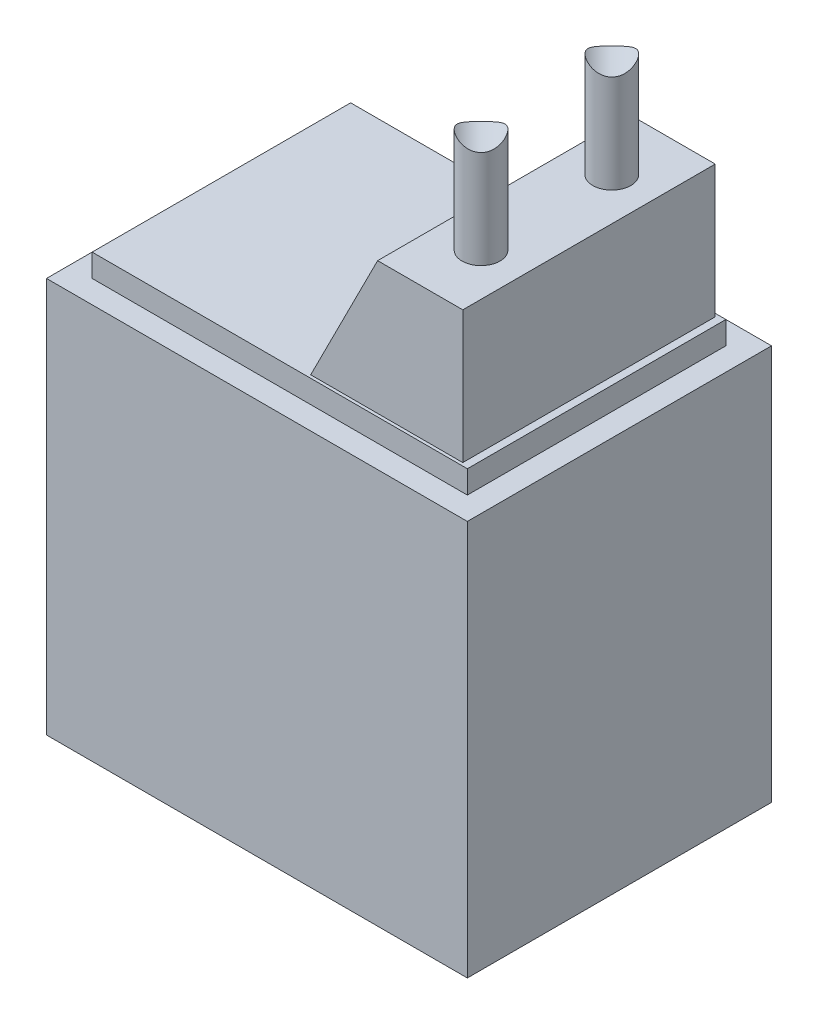
ISO-10303-21;
HEADER;
FILE_DESCRIPTION(('STEP AP214'),'2;1');
FILE_NAME('part.step','',(''),(''),'','','');
FILE_SCHEMA(('AUTOMOTIVE_DESIGN { 1 0 10303 214 1 1 1 1 }'));
ENDSEC;
DATA;
#1=APPLICATION_CONTEXT('core data for automotive mechanical design processes');
#2=APPLICATION_PROTOCOL_DEFINITION('international standard','automotive_design',2000,#1);
#3=PRODUCT_CONTEXT('',#1,'mechanical');
#4=PRODUCT('Part','Part','',(#3));
#5=PRODUCT_RELATED_PRODUCT_CATEGORY('part','',(#4));
#6=PRODUCT_DEFINITION_FORMATION('','',#4);
#7=PRODUCT_DEFINITION_CONTEXT('part definition',#1,'design');
#8=PRODUCT_DEFINITION('design','',#6,#7);
#9=PRODUCT_DEFINITION_SHAPE('','',#8);
#10=(LENGTH_UNIT() NAMED_UNIT(*) SI_UNIT(.MILLI.,.METRE.));
#11=(NAMED_UNIT(*) PLANE_ANGLE_UNIT() SI_UNIT($,.RADIAN.));
#12=(NAMED_UNIT(*) SI_UNIT($,.STERADIAN.) SOLID_ANGLE_UNIT());
#13=UNCERTAINTY_MEASURE_WITH_UNIT(LENGTH_MEASURE(1.E-05),#10,'distance_accuracy_value','');
#14=(GEOMETRIC_REPRESENTATION_CONTEXT(3) GLOBAL_UNCERTAINTY_ASSIGNED_CONTEXT((#13)) GLOBAL_UNIT_ASSIGNED_CONTEXT((#10,
#11,#12)) REPRESENTATION_CONTEXT('',''));
#15=CARTESIAN_POINT('',(0.,0.,0.));
#16=DIRECTION('',(0.,0.,1.));
#17=DIRECTION('',(1.,0.,0.));
#18=AXIS2_PLACEMENT_3D('',#15,#16,#17);
#19=CARTESIAN_POINT('',(20.4815,6.5,5.));
#20=DIRECTION('',(0.,0.,1.));
#21=DIRECTION('',(1.,0.,0.));
#22=AXIS2_PLACEMENT_3D('',#19,#20,#21);
#23=PLANE('',#22);
#24=DIRECTION('',(-1.,0.,0.));
#25=VECTOR('',#24,1.);
#26=CARTESIAN_POINT('',(20.4815,0.,5.));
#27=LINE('',#26,#25);
#28=CARTESIAN_POINT('',(27.4,0.,5.));
#29=VERTEX_POINT('',#28);
#30=CARTESIAN_POINT('',(13.563,0.,5.));
#31=VERTEX_POINT('',#30);
#32=EDGE_CURVE('E225',#29,#31,#27,.T.);
#33=ORIENTED_EDGE('',*,*,#32,.F.);
#34=DIRECTION('',(0.,-1.,0.));
#35=VECTOR('',#34,1.);
#36=CARTESIAN_POINT('',(27.4,6.5,5.));
#37=LINE('',#36,#35);
#38=CARTESIAN_POINT('',(27.4,13.,5.));
#39=VERTEX_POINT('',#38);
#40=EDGE_CURVE('E215',#39,#29,#37,.T.);
#41=ORIENTED_EDGE('',*,*,#40,.F.);
#42=DIRECTION('',(1.,0.,0.));
#43=VECTOR('',#42,1.);
#44=CARTESIAN_POINT('',(20.4815,13.,5.));
#45=LINE('',#44,#43);
#46=CARTESIAN_POINT('',(13.563,13.,5.));
#47=VERTEX_POINT('',#46);
#48=EDGE_CURVE('E219',#47,#39,#45,.T.);
#49=ORIENTED_EDGE('',*,*,#48,.F.);
#50=DIRECTION('',(0.,1.,0.));
#51=VECTOR('',#50,1.);
#52=CARTESIAN_POINT('',(13.563,6.5,5.));
#53=LINE('',#52,#51);
#54=EDGE_CURVE('E222',#31,#47,#53,.T.);
#55=ORIENTED_EDGE('',*,*,#54,.F.);
#56=EDGE_LOOP('',(#33,#41,#49,#55));
#57=FACE_BOUND('',#56,.T.);
#58=ADVANCED_FACE('F16',(#57),#23,.T.);
#59=CARTESIAN_POINT('',(20.4815,0.,-5.));
#60=DIRECTION('',(0.,-1.,0.));
#61=DIRECTION('',(0.,0.,-1.));
#62=AXIS2_PLACEMENT_3D('',#59,#60,#61);
#63=PLANE('',#62);
#64=DIRECTION('',(0.,0.,1.));
#65=VECTOR('',#64,1.);
#66=CARTESIAN_POINT('',(27.4,0.,-5.));
#67=LINE('',#66,#65);
#68=CARTESIAN_POINT('',(27.4,0.,-5.));
#69=VERTEX_POINT('',#68);
#70=EDGE_CURVE('E192',#69,#29,#67,.T.);
#71=ORIENTED_EDGE('',*,*,#70,.T.);
#72=ORIENTED_EDGE('',*,*,#32,.T.);
#73=DIRECTION('',(0.,0.,1.));
#74=VECTOR('',#73,1.);
#75=CARTESIAN_POINT('',(13.563,0.,-5.));
#76=LINE('',#75,#74);
#77=CARTESIAN_POINT('',(13.563,0.,-5.));
#78=VERTEX_POINT('',#77);
#79=EDGE_CURVE('E211',#78,#31,#76,.T.);
#80=ORIENTED_EDGE('',*,*,#79,.F.);
#81=DIRECTION('',(1.,0.,0.));
#82=VECTOR('',#81,1.);
#83=CARTESIAN_POINT('',(20.4815,0.,-5.));
#84=LINE('',#83,#82);
#85=EDGE_CURVE('E183',#78,#69,#84,.T.);
#86=ORIENTED_EDGE('',*,*,#85,.T.);
#87=EDGE_LOOP('',(#71,#72,#80,#86));
#88=FACE_BOUND('',#87,.T.);
#89=ADVANCED_FACE('F293',(#88),#63,.T.);
#90=CARTESIAN_POINT('',(13.563,6.5,-5.));
#91=DIRECTION('',(-1.,0.,0.));
#92=DIRECTION('',(0.,0.,1.));
#93=AXIS2_PLACEMENT_3D('',#90,#91,#92);
#94=PLANE('',#93);
#95=CARTESIAN_POINT('',(13.563,6.5,0.));
#96=DIRECTION('',(-1.,0.,0.));
#97=DIRECTION('',(0.,0.,1.));
#98=AXIS2_PLACEMENT_3D('',#95,#96,#97);
#99=CIRCLE('',#98,1.);
#100=CARTESIAN_POINT('',(13.563,6.5,1.));
#101=VERTEX_POINT('',#100);
#102=EDGE_CURVE('E19',#101,#101,#99,.T.);
#103=ORIENTED_EDGE('',*,*,#102,.F.);
#104=EDGE_LOOP('',(#103));
#105=FACE_BOUND('',#104,.T.);
#106=ORIENTED_EDGE('',*,*,#79,.T.);
#107=ORIENTED_EDGE('',*,*,#54,.T.);
#108=DIRECTION('',(0.,0.,1.));
#109=VECTOR('',#108,1.);
#110=CARTESIAN_POINT('',(13.563,13.,-5.));
#111=LINE('',#110,#109);
#112=CARTESIAN_POINT('',(13.563,13.,-5.));
#113=VERTEX_POINT('',#112);
#114=EDGE_CURVE('E207',#113,#47,#111,.T.);
#115=ORIENTED_EDGE('',*,*,#114,.F.);
#116=DIRECTION('',(0.,-1.,0.));
#117=VECTOR('',#116,1.);
#118=CARTESIAN_POINT('',(13.563,6.5,-5.));
#119=LINE('',#118,#117);
#120=EDGE_CURVE('E187',#113,#78,#119,.T.);
#121=ORIENTED_EDGE('',*,*,#120,.T.);
#122=EDGE_LOOP('',(#106,#107,#115,#121));
#123=FACE_BOUND('',#122,.T.);
#124=ADVANCED_FACE('F298',(#105,#123),#94,.T.);
#125=CARTESIAN_POINT('',(20.4815,13.,-5.));
#126=DIRECTION('',(0.,1.,0.));
#127=DIRECTION('',(0.,0.,1.));
#128=AXIS2_PLACEMENT_3D('',#125,#126,#127);
#129=PLANE('',#128);
#130=DIRECTION('',(1.,0.,0.));
#131=VECTOR('',#130,1.);
#132=CARTESIAN_POINT('',(20.4815,13.,4.25));
#133=LINE('',#132,#131);
#134=CARTESIAN_POINT('',(14.313,13.,4.25));
#135=VERTEX_POINT('',#134);
#136=CARTESIAN_POINT('',(26.65,13.,4.25));
#137=VERTEX_POINT('',#136);
#138=EDGE_CURVE('E41',#135,#137,#133,.T.);
#139=ORIENTED_EDGE('',*,*,#138,.F.);
#140=DIRECTION('',(0.,0.,1.));
#141=VECTOR('',#140,1.);
#142=CARTESIAN_POINT('',(14.313,13.,-5.));
#143=LINE('',#142,#141);
#144=CARTESIAN_POINT('',(14.313,13.,-4.25));
#145=VERTEX_POINT('',#144);
#146=EDGE_CURVE('E236',#145,#135,#143,.T.);
#147=ORIENTED_EDGE('',*,*,#146,.F.);
#148=DIRECTION('',(-1.,0.,0.));
#149=VECTOR('',#148,1.);
#150=CARTESIAN_POINT('',(20.4815,13.,-4.25));
#151=LINE('',#150,#149);
#152=CARTESIAN_POINT('',(26.65,13.,-4.25));
#153=VERTEX_POINT('',#152);
#154=EDGE_CURVE('E232',#153,#145,#151,.T.);
#155=ORIENTED_EDGE('',*,*,#154,.F.);
#156=DIRECTION('',(0.,0.,-1.));
#157=VECTOR('',#156,1.);
#158=CARTESIAN_POINT('',(26.65,13.,-5.));
#159=LINE('',#158,#157);
#160=EDGE_CURVE('E228',#137,#153,#159,.T.);
#161=ORIENTED_EDGE('',*,*,#160,.F.);
#162=EDGE_LOOP('',(#139,#147,#155,#161));
#163=FACE_BOUND('',#162,.T.);
#164=ORIENTED_EDGE('',*,*,#114,.T.);
#165=ORIENTED_EDGE('',*,*,#48,.T.);
#166=DIRECTION('',(0.,0.,1.));
#167=VECTOR('',#166,1.);
#168=CARTESIAN_POINT('',(27.4,13.,-5.));
#169=LINE('',#168,#167);
#170=CARTESIAN_POINT('',(27.4,13.,-5.));
#171=VERTEX_POINT('',#170);
#172=EDGE_CURVE('E203',#171,#39,#169,.T.);
#173=ORIENTED_EDGE('',*,*,#172,.F.);
#174=DIRECTION('',(-1.,0.,0.));
#175=VECTOR('',#174,1.);
#176=CARTESIAN_POINT('',(20.4815,13.,-5.));
#177=LINE('',#176,#175);
#178=EDGE_CURVE('E193',#171,#113,#177,.T.);
#179=ORIENTED_EDGE('',*,*,#178,.T.);
#180=EDGE_LOOP('',(#164,#165,#173,#179));
#181=FACE_BOUND('',#180,.T.);
#182=ADVANCED_FACE('F312',(#163,#181),#129,.T.);
#183=CARTESIAN_POINT('',(20.4815,6.5,-5.));
#184=DIRECTION('',(0.,0.,-1.));
#185=DIRECTION('',(-1.,0.,0.));
#186=AXIS2_PLACEMENT_3D('',#183,#184,#185);
#187=PLANE('',#186);
#188=DIRECTION('',(0.,1.,0.));
#189=VECTOR('',#188,1.);
#190=CARTESIAN_POINT('',(27.4,6.5,-5.));
#191=LINE('',#190,#189);
#192=EDGE_CURVE('E188',#69,#171,#191,.T.);
#193=ORIENTED_EDGE('',*,*,#192,.F.);
#194=ORIENTED_EDGE('',*,*,#85,.F.);
#195=ORIENTED_EDGE('',*,*,#120,.F.);
#196=ORIENTED_EDGE('',*,*,#178,.F.);
#197=EDGE_LOOP('',(#193,#194,#195,#196));
#198=FACE_BOUND('',#197,.T.);
#199=ADVANCED_FACE('F310',(#198),#187,.T.);
#200=CARTESIAN_POINT('',(27.4,6.5,-5.));
#201=DIRECTION('',(1.,0.,0.));
#202=DIRECTION('',(0.,0.,-1.));
#203=AXIS2_PLACEMENT_3D('',#200,#201,#202);
#204=PLANE('',#203);
#205=ORIENTED_EDGE('',*,*,#192,.T.);
#206=ORIENTED_EDGE('',*,*,#172,.T.);
#207=ORIENTED_EDGE('',*,*,#40,.T.);
#208=ORIENTED_EDGE('',*,*,#70,.F.);
#209=EDGE_LOOP('',(#205,#206,#207,#208));
#210=FACE_BOUND('',#209,.T.);
#211=ADVANCED_FACE('F304',(#210),#204,.T.);
#212=CARTESIAN_POINT('',(20.4815,12.875,4.25));
#213=DIRECTION('',(0.,0.,1.));
#214=DIRECTION('',(1.,0.,0.));
#215=AXIS2_PLACEMENT_3D('',#212,#213,#214);
#216=PLANE('',#215);
#217=DIRECTION('',(0.,1.,0.));
#218=VECTOR('',#217,1.);
#219=CARTESIAN_POINT('',(14.313,12.875,4.25));
#220=LINE('',#219,#218);
#221=CARTESIAN_POINT('',(14.313,13.75,4.25));
#222=VERTEX_POINT('',#221);
#223=EDGE_CURVE('E180',#135,#222,#220,.T.);
#224=ORIENTED_EDGE('',*,*,#223,.F.);
#225=ORIENTED_EDGE('',*,*,#138,.T.);
#226=DIRECTION('',(0.,-1.,0.));
#227=VECTOR('',#226,1.);
#228=CARTESIAN_POINT('',(26.65,12.875,4.25));
#229=LINE('',#228,#227);
#230=CARTESIAN_POINT('',(26.65,13.75,4.25));
#231=VERTEX_POINT('',#230);
#232=EDGE_CURVE('E173',#231,#137,#229,.T.);
#233=ORIENTED_EDGE('',*,*,#232,.F.);
#234=DIRECTION('',(1.,0.,0.));
#235=VECTOR('',#234,1.);
#236=CARTESIAN_POINT('',(20.4815,13.75,4.25));
#237=LINE('',#236,#235);
#238=EDGE_CURVE('E177',#222,#231,#237,.T.);
#239=ORIENTED_EDGE('',*,*,#238,.F.);
#240=EDGE_LOOP('',(#224,#225,#233,#239));
#241=FACE_BOUND('',#240,.T.);
#242=ADVANCED_FACE('F325',(#241),#216,.T.);
#243=CARTESIAN_POINT('',(14.313,12.875,-4.25));
#244=DIRECTION('',(-1.,0.,0.));
#245=DIRECTION('',(0.,0.,1.));
#246=AXIS2_PLACEMENT_3D('',#243,#244,#245);
#247=PLANE('',#246);
#248=DIRECTION('',(0.,-1.,0.));
#249=VECTOR('',#248,1.);
#250=CARTESIAN_POINT('',(14.313,12.875,-4.25));
#251=LINE('',#250,#249);
#252=CARTESIAN_POINT('',(14.313,13.75,-4.25));
#253=VERTEX_POINT('',#252);
#254=EDGE_CURVE('E151',#253,#145,#251,.T.);
#255=ORIENTED_EDGE('',*,*,#254,.T.);
#256=ORIENTED_EDGE('',*,*,#146,.T.);
#257=ORIENTED_EDGE('',*,*,#223,.T.);
#258=DIRECTION('',(0.,0.,1.));
#259=VECTOR('',#258,1.);
#260=CARTESIAN_POINT('',(14.313,13.75,-4.25));
#261=LINE('',#260,#259);
#262=EDGE_CURVE('E169',#253,#222,#261,.T.);
#263=ORIENTED_EDGE('',*,*,#262,.F.);
#264=EDGE_LOOP('',(#255,#256,#257,#263));
#265=FACE_BOUND('',#264,.T.);
#266=ADVANCED_FACE('F330',(#265),#247,.T.);
#267=CARTESIAN_POINT('',(20.4815,13.75,-4.25));
#268=DIRECTION('',(0.,1.,0.));
#269=DIRECTION('',(0.,0.,1.));
#270=AXIS2_PLACEMENT_3D('',#267,#268,#269);
#271=PLANE('',#270);
#272=DIRECTION('',(1.,0.,0.));
#273=VECTOR('',#272,1.);
#274=CARTESIAN_POINT('',(20.4815,13.75,4.15));
#275=LINE('',#274,#273);
#276=CARTESIAN_POINT('',(21.4,13.75,4.15));
#277=VERTEX_POINT('',#276);
#278=CARTESIAN_POINT('',(26.4,13.75,4.15));
#279=VERTEX_POINT('',#278);
#280=EDGE_CURVE('E11',#277,#279,#275,.T.);
#281=ORIENTED_EDGE('',*,*,#280,.F.);
#282=DIRECTION('',(0.,0.,-1.));
#283=VECTOR('',#282,1.);
#284=CARTESIAN_POINT('',(21.4,13.75,4.15));
#285=LINE('',#284,#283);
#286=CARTESIAN_POINT('',(21.4,13.75,-4.15));
#287=VERTEX_POINT('',#286);
#288=EDGE_CURVE('E123',#277,#287,#285,.T.);
#289=ORIENTED_EDGE('',*,*,#288,.T.);
#290=DIRECTION('',(1.,0.,0.));
#291=VECTOR('',#290,1.);
#292=CARTESIAN_POINT('',(20.4815,13.75,-4.15));
#293=LINE('',#292,#291);
#294=CARTESIAN_POINT('',(26.4,13.75,-4.15));
#295=VERTEX_POINT('',#294);
#296=EDGE_CURVE('E241',#287,#295,#293,.T.);
#297=ORIENTED_EDGE('',*,*,#296,.T.);
#298=DIRECTION('',(0.,0.,1.));
#299=VECTOR('',#298,1.);
#300=CARTESIAN_POINT('',(26.4,13.75,-4.25));
#301=LINE('',#300,#299);
#302=EDGE_CURVE('E25',#295,#279,#301,.T.);
#303=ORIENTED_EDGE('',*,*,#302,.T.);
#304=EDGE_LOOP('',(#281,#289,#297,#303));
#305=FACE_BOUND('',#304,.T.);
#306=ORIENTED_EDGE('',*,*,#262,.T.);
#307=ORIENTED_EDGE('',*,*,#238,.T.);
#308=DIRECTION('',(0.,0.,1.));
#309=VECTOR('',#308,1.);
#310=CARTESIAN_POINT('',(26.65,13.75,-4.25));
#311=LINE('',#310,#309);
#312=CARTESIAN_POINT('',(26.65,13.75,-4.25));
#313=VERTEX_POINT('',#312);
#314=EDGE_CURVE('E158',#313,#231,#311,.T.);
#315=ORIENTED_EDGE('',*,*,#314,.F.);
#316=DIRECTION('',(-1.,0.,0.));
#317=VECTOR('',#316,1.);
#318=CARTESIAN_POINT('',(20.4815,13.75,-4.25));
#319=LINE('',#318,#317);
#320=EDGE_CURVE('E159',#313,#253,#319,.T.);
#321=ORIENTED_EDGE('',*,*,#320,.T.);
#322=EDGE_LOOP('',(#306,#307,#315,#321));
#323=FACE_BOUND('',#322,.T.);
#324=ADVANCED_FACE('F334',(#305,#323),#271,.T.);
#325=CARTESIAN_POINT('',(20.4815,12.875,-4.25));
#326=DIRECTION('',(0.,0.,-1.));
#327=DIRECTION('',(-1.,0.,0.));
#328=AXIS2_PLACEMENT_3D('',#325,#326,#327);
#329=PLANE('',#328);
#330=DIRECTION('',(0.,1.,0.));
#331=VECTOR('',#330,1.);
#332=CARTESIAN_POINT('',(26.65,12.875,-4.25));
#333=LINE('',#332,#331);
#334=EDGE_CURVE('E155',#153,#313,#333,.T.);
#335=ORIENTED_EDGE('',*,*,#334,.F.);
#336=ORIENTED_EDGE('',*,*,#154,.T.);
#337=ORIENTED_EDGE('',*,*,#254,.F.);
#338=ORIENTED_EDGE('',*,*,#320,.F.);
#339=EDGE_LOOP('',(#335,#336,#337,#338));
#340=FACE_BOUND('',#339,.T.);
#341=ADVANCED_FACE('F338',(#340),#329,.T.);
#342=CARTESIAN_POINT('',(26.65,12.875,-4.25));
#343=DIRECTION('',(1.,0.,0.));
#344=DIRECTION('',(0.,0.,-1.));
#345=AXIS2_PLACEMENT_3D('',#342,#343,#344);
#346=PLANE('',#345);
#347=ORIENTED_EDGE('',*,*,#232,.T.);
#348=ORIENTED_EDGE('',*,*,#160,.T.);
#349=ORIENTED_EDGE('',*,*,#334,.T.);
#350=ORIENTED_EDGE('',*,*,#314,.T.);
#351=EDGE_LOOP('',(#347,#348,#349,#350));
#352=FACE_BOUND('',#351,.T.);
#353=ADVANCED_FACE('F340',(#352),#346,.T.);
#354=CARTESIAN_POINT('',(26.4,18.1,4.15));
#355=DIRECTION('',(0.,-1.,0.));
#356=DIRECTION('',(0.,0.,-1.));
#357=AXIS2_PLACEMENT_3D('',#354,#355,#356);
#358=PLANE('',#357);
#359=CARTESIAN_POINT('',(25.,18.1,2.15));
#360=DIRECTION('',(0.,-1.,0.));
#361=DIRECTION('',(0.,0.,-1.));
#362=AXIS2_PLACEMENT_3D('',#359,#360,#361);
#363=CIRCLE('',#362,0.625);
#364=CARTESIAN_POINT('',(25.,18.1,1.525));
#365=VERTEX_POINT('',#364);
#366=EDGE_CURVE('E245',#365,#365,#363,.T.);
#367=ORIENTED_EDGE('',*,*,#366,.T.);
#368=EDGE_LOOP('',(#367));
#369=FACE_BOUND('',#368,.T.);
#370=CARTESIAN_POINT('',(25.,18.1,-2.15));
#371=DIRECTION('',(0.,-1.,0.));
#372=DIRECTION('',(0.,0.,-1.));
#373=AXIS2_PLACEMENT_3D('',#370,#371,#372);
#374=CIRCLE('',#373,0.625);
#375=CARTESIAN_POINT('',(25.,18.1,-2.775));
#376=VERTEX_POINT('',#375);
#377=EDGE_CURVE('E129',#376,#376,#374,.T.);
#378=ORIENTED_EDGE('',*,*,#377,.T.);
#379=EDGE_LOOP('',(#378));
#380=FACE_BOUND('',#379,.T.);
#381=DIRECTION('',(-1.,0.,0.));
#382=VECTOR('',#381,1.);
#383=CARTESIAN_POINT('',(26.4,18.1,-4.15));
#384=LINE('',#383,#382);
#385=CARTESIAN_POINT('',(26.4,18.1,-4.15));
#386=VERTEX_POINT('',#385);
#387=CARTESIAN_POINT('',(23.6,18.1,-4.15));
#388=VERTEX_POINT('',#387);
#389=EDGE_CURVE('E120',#386,#388,#384,.T.);
#390=ORIENTED_EDGE('',*,*,#389,.T.);
#391=DIRECTION('',(0.,0.,-1.));
#392=VECTOR('',#391,1.);
#393=CARTESIAN_POINT('',(23.6,18.1,4.15));
#394=LINE('',#393,#392);
#395=CARTESIAN_POINT('',(23.6,18.1,4.15));
#396=VERTEX_POINT('',#395);
#397=EDGE_CURVE('E149',#396,#388,#394,.T.);
#398=ORIENTED_EDGE('',*,*,#397,.F.);
#399=DIRECTION('',(-1.,0.,0.));
#400=VECTOR('',#399,1.);
#401=CARTESIAN_POINT('',(26.4,18.1,4.15));
#402=LINE('',#401,#400);
#403=CARTESIAN_POINT('',(26.4,18.1,4.15));
#404=VERTEX_POINT('',#403);
#405=EDGE_CURVE('E113',#404,#396,#402,.T.);
#406=ORIENTED_EDGE('',*,*,#405,.F.);
#407=DIRECTION('',(0.,0.,-1.));
#408=VECTOR('',#407,1.);
#409=CARTESIAN_POINT('',(26.4,18.1,4.15));
#410=LINE('',#409,#408);
#411=EDGE_CURVE('E108',#404,#386,#410,.T.);
#412=ORIENTED_EDGE('',*,*,#411,.T.);
#413=EDGE_LOOP('',(#390,#398,#406,#412));
#414=FACE_BOUND('',#413,.T.);
#415=ADVANCED_FACE('F118',(#369,#380,#414),#358,.F.);
#416=CARTESIAN_POINT('',(21.4,13.75,4.15));
#417=DIRECTION('',(-0.892366363951396,0.451311724297258,0.));
#418=DIRECTION('',(-0.451311724297258,-0.892366363951396,0.));
#419=AXIS2_PLACEMENT_3D('',#416,#417,#418);
#420=PLANE('',#419);
#421=DIRECTION('',(0.451311724297258,0.892366363951396,0.));
#422=VECTOR('',#421,1.);
#423=CARTESIAN_POINT('',(21.4,13.75,-4.15));
#424=LINE('',#423,#422);
#425=EDGE_CURVE('E114',#287,#388,#424,.T.);
#426=ORIENTED_EDGE('',*,*,#425,.F.);
#427=ORIENTED_EDGE('',*,*,#288,.F.);
#428=DIRECTION('',(0.451311724297258,0.892366363951396,0.));
#429=VECTOR('',#428,1.);
#430=CARTESIAN_POINT('',(21.4,13.75,4.15));
#431=LINE('',#430,#429);
#432=EDGE_CURVE('E143',#277,#396,#431,.T.);
#433=ORIENTED_EDGE('',*,*,#432,.T.);
#434=ORIENTED_EDGE('',*,*,#397,.T.);
#435=EDGE_LOOP('',(#426,#427,#433,#434));
#436=FACE_BOUND('',#435,.T.);
#437=ADVANCED_FACE('F349',(#436),#420,.T.);
#438=CARTESIAN_POINT('',(26.4,12.1869324589437,4.15));
#439=DIRECTION('',(-1.,0.,0.));
#440=DIRECTION('',(0.,0.,1.));
#441=AXIS2_PLACEMENT_3D('',#438,#439,#440);
#442=PLANE('',#441);
#443=ORIENTED_EDGE('',*,*,#302,.F.);
#444=DIRECTION('',(0.,1.,0.));
#445=VECTOR('',#444,1.);
#446=CARTESIAN_POINT('',(26.4,12.1869324589437,-4.15));
#447=LINE('',#446,#445);
#448=EDGE_CURVE('E33',#295,#386,#447,.T.);
#449=ORIENTED_EDGE('',*,*,#448,.T.);
#450=ORIENTED_EDGE('',*,*,#411,.F.);
#451=DIRECTION('',(0.,1.,0.));
#452=VECTOR('',#451,1.);
#453=CARTESIAN_POINT('',(26.4,12.1869324589437,4.15));
#454=LINE('',#453,#452);
#455=EDGE_CURVE('E124',#279,#404,#454,.T.);
#456=ORIENTED_EDGE('',*,*,#455,.F.);
#457=EDGE_LOOP('',(#443,#449,#450,#456));
#458=FACE_BOUND('',#457,.T.);
#459=ADVANCED_FACE('F106',(#458),#442,.F.);
#460=CARTESIAN_POINT('',(21.4,18.1,4.15));
#461=DIRECTION('',(0.,0.,1.));
#462=DIRECTION('',(1.,0.,0.));
#463=AXIS2_PLACEMENT_3D('',#460,#461,#462);
#464=PLANE('',#463);
#465=ORIENTED_EDGE('',*,*,#432,.F.);
#466=ORIENTED_EDGE('',*,*,#280,.T.);
#467=ORIENTED_EDGE('',*,*,#455,.T.);
#468=ORIENTED_EDGE('',*,*,#405,.T.);
#469=EDGE_LOOP('',(#465,#466,#467,#468));
#470=FACE_BOUND('',#469,.T.);
#471=ADVANCED_FACE('F355',(#470),#464,.T.);
#472=CARTESIAN_POINT('',(21.4,18.1,-4.15));
#473=DIRECTION('',(0.,0.,1.));
#474=DIRECTION('',(1.,0.,0.));
#475=AXIS2_PLACEMENT_3D('',#472,#473,#474);
#476=PLANE('',#475);
#477=ORIENTED_EDGE('',*,*,#296,.F.);
#478=ORIENTED_EDGE('',*,*,#425,.T.);
#479=ORIENTED_EDGE('',*,*,#389,.F.);
#480=ORIENTED_EDGE('',*,*,#448,.F.);
#481=EDGE_LOOP('',(#477,#478,#479,#480));
#482=FACE_BOUND('',#481,.T.);
#483=ADVANCED_FACE('F126',(#482),#476,.F.);
#484=CARTESIAN_POINT('',(25.,17.1,-2.15));
#485=DIRECTION('',(0.,1.,0.));
#486=DIRECTION('',(1.,0.,0.));
#487=AXIS2_PLACEMENT_3D('',#484,#485,#486);
#488=CYLINDRICAL_SURFACE('',#487,0.625);
#489=CARTESIAN_POINT('',(25.625,21.4223314942998,-2.15));
#490=CARTESIAN_POINT('',(25.6250002126282,21.4344702304814,-2.18484190319325));
#491=CARTESIAN_POINT('',(25.6220912382829,21.4468382065455,-2.21961897065606));
#492=CARTESIAN_POINT('',(25.6104551625194,21.4708118518763,-2.28853811855073));
#493=CARTESIAN_POINT('',(25.6017181827252,21.4824161900366,-2.32267901952191));
#494=CARTESIAN_POINT('',(25.5801400917468,21.5017672108485,-2.38443451389746));
#495=CARTESIAN_POINT('',(25.5681431719944,21.5098329641189,-2.41224155238747));
#496=CARTESIAN_POINT('',(25.5399278584822,21.5233910676087,-2.46627257974379));
#497=CARTESIAN_POINT('',(25.5237174660888,21.5288882407845,-2.49249945429052));
#498=CARTESIAN_POINT('',(25.4871503770834,21.5364988100708,-2.54278704319563));
#499=CARTESIAN_POINT('',(25.4667627204841,21.5385858300134,-2.56682952671763));
#500=CARTESIAN_POINT('',(25.4225701228967,21.5388960323469,-2.61157077709497));
#501=CARTESIAN_POINT('',(25.398765341116,21.5371193946949,-2.63226969963481));
#502=CARTESIAN_POINT('',(25.351639841221,21.5304650236557,-2.66743270238643));
#503=CARTESIAN_POINT('',(25.3285916209034,21.5259766935475,-2.68234379478615));
#504=CARTESIAN_POINT('',(25.2811580304916,21.5148393416182,-2.70885067148407));
#505=CARTESIAN_POINT('',(25.2567720400434,21.508189310206,-2.72044490192427));
#506=CARTESIAN_POINT('',(25.2042344296544,21.4925412102028,-2.74144270509043));
#507=CARTESIAN_POINT('',(25.1759744793064,21.4833601059638,-2.75043526197377));
#508=CARTESIAN_POINT('',(25.1187834724901,21.4640321369135,-2.76431481577801));
#509=CARTESIAN_POINT('',(25.0898519438889,21.4538845760939,-2.76919882859728));
#510=CARTESIAN_POINT('',(25.025558466307,21.4312690134096,-2.77547688770389));
#511=CARTESIAN_POINT('',(24.9901155035416,21.4187590188076,-2.77592898803294));
#512=CARTESIAN_POINT('',(24.9193088165788,21.3947046599077,-2.77078511154136));
#513=CARTESIAN_POINT('',(24.8839451476616,21.38316083857,-2.76518575825133));
#514=CARTESIAN_POINT('',(24.8130184005987,21.3618509686233,-2.74752608943123));
#515=CARTESIAN_POINT('',(24.7774822937383,21.3521500785493,-2.73527343581211));
#516=CARTESIAN_POINT('',(24.7085980820999,21.3361274474444,-2.704194263189));
#517=CARTESIAN_POINT('',(24.6752466158474,21.3298004026353,-2.68537813963899));
#518=CARTESIAN_POINT('',(24.6166709880078,21.321948892229,-2.64474235725992));
#519=CARTESIAN_POINT('',(24.5909644025661,21.3198719622158,-2.62372328229572));
#520=CARTESIAN_POINT('',(24.5431927202884,21.3190380362656,-2.57783986786171));
#521=CARTESIAN_POINT('',(24.5211259499893,21.3202795100971,-2.5529773057394));
#522=CARTESIAN_POINT('',(24.4832442350147,21.3256716005542,-2.50282068870559));
#523=CARTESIAN_POINT('',(24.4670352514762,21.3295357579026,-2.4777901876784));
#524=CARTESIAN_POINT('',(24.4384861044904,21.3395360066769,-2.42604463894822));
#525=CARTESIAN_POINT('',(24.4261464052336,21.3456723705025,-2.39932938959068));
#526=CARTESIAN_POINT('',(24.404861387581,21.3601443262071,-2.34334424196573));
#527=CARTESIAN_POINT('',(24.3961446280213,21.3685837603589,-2.31401504194133));
#528=CARTESIAN_POINT('',(24.3831049999525,21.3868393743791,-2.25481302721621));
#529=CARTESIAN_POINT('',(24.3787850267798,21.3966564566107,-2.22493986747172));
#530=CARTESIAN_POINT('',(24.3741512812605,21.4184509975197,-2.16079808060764));
#531=CARTESIAN_POINT('',(24.3745056529464,21.4305357700383,-2.12651729888248));
#532=CARTESIAN_POINT('',(24.3808046604498,21.4545076515279,-2.05838454869075));
#533=CARTESIAN_POINT('',(24.3867515424074,21.4663946791256,-2.02453275805812));
#534=CARTESIAN_POINT('',(24.4034701660617,21.4876592324039,-1.96090895909242));
#535=CARTESIAN_POINT('',(24.4137414401413,21.4971673469859,-1.93105043523591));
#536=CARTESIAN_POINT('',(24.4389826998338,21.51387886974,-1.87270556636919));
#537=CARTESIAN_POINT('',(24.4539471656558,21.5210849653844,-1.84421765451146));
#538=CARTESIAN_POINT('',(24.488652644664,21.5321536483854,-1.78914534429623));
#539=CARTESIAN_POINT('',(24.5084385404288,21.5359831582401,-1.76258206749737));
#540=CARTESIAN_POINT('',(24.5521424047172,21.539408828941,-1.71280175227308));
#541=CARTESIAN_POINT('',(24.5760563862003,21.5390090523158,-1.68958152434663));
#542=CARTESIAN_POINT('',(24.6230447367113,21.534464871639,-1.65068632372134));
#543=CARTESIAN_POINT('',(24.6456790588146,21.5309079255715,-1.63439994261983));
#544=CARTESIAN_POINT('',(24.692528447713,21.5213497496357,-1.6051611406306));
#545=CARTESIAN_POINT('',(24.7167445011021,21.5153469817387,-1.59221082597167));
#546=CARTESIAN_POINT('',(24.7679029487615,21.5011045392228,-1.56896729134442));
#547=CARTESIAN_POINT('',(24.7949187487773,21.4927404857054,-1.55891471707405));
#548=CARTESIAN_POINT('',(24.8496998206665,21.47482637926,-1.54266797673519));
#549=CARTESIAN_POINT('',(24.8774654721386,21.465275716478,-1.5364758046276));
#550=CARTESIAN_POINT('',(24.9394797118545,21.443620991047,-1.52698537295751));
#551=CARTESIAN_POINT('',(24.9738337220715,21.4314108351745,-1.52460055279515));
#552=CARTESIAN_POINT('',(25.0426800572695,21.4075089988477,-1.5255085335565));
#553=CARTESIAN_POINT('',(25.0771724770785,21.3958177821324,-1.52880631185179));
#554=CARTESIAN_POINT('',(25.1481490173877,21.3732293975006,-1.5416667593548));
#555=CARTESIAN_POINT('',(25.1845948569224,21.3624523867068,-1.55166893514819));
#556=CARTESIAN_POINT('',(25.2557308742338,21.3439738253584,-1.57845360782739));
#557=CARTESIAN_POINT('',(25.2904234361192,21.3362679946724,-1.59522660247403));
#558=CARTESIAN_POINT('',(25.3524317759034,21.3256354080849,-1.63273766639526));
#559=CARTESIAN_POINT('',(25.3801266141218,21.3222295898213,-1.65271204924023));
#560=CARTESIAN_POINT('',(25.4319860711494,21.3189075353264,-1.69703904098893));
#561=CARTESIAN_POINT('',(25.4561535155134,21.3189884905142,-1.72138811035726));
#562=CARTESIAN_POINT('',(25.4974994012974,21.3224074343924,-1.77048978234128));
#563=CARTESIAN_POINT('',(25.5151643216461,21.3253642343461,-1.7948637031527));
#564=CARTESIAN_POINT('',(25.5466717777647,21.3337190451626,-1.84558789215377));
#565=CARTESIAN_POINT('',(25.5605125913872,21.3391181530167,-1.87193904399871));
#566=CARTESIAN_POINT('',(25.5845559974341,21.3521229535056,-1.92674386550309));
#567=CARTESIAN_POINT('',(25.5946320548754,21.3597920485777,-1.95523743630001));
#568=CARTESIAN_POINT('',(25.6105104641223,21.3766731387312,-2.01290188667085));
#569=CARTESIAN_POINT('',(25.6163169799503,21.3858836197271,-2.04207207762113));
#570=CARTESIAN_POINT('',(25.6233519944875,21.4041906455608,-2.09752080077024));
#571=CARTESIAN_POINT('',(25.6249998399808,21.4131961522698,-2.1237787609945));
#572=CARTESIAN_POINT('',(25.625,21.4223314942998,-2.15));
#573=B_SPLINE_CURVE_WITH_KNOTS('',3,(#489,#490,#491,#492,#493,#494,#495,#496,#497,#498,#499,
#500,#501,#502,#503,#504,#505,#506,#507,#508,#509,#510,#511,#512,#513,#514,#515,#516,#517,#518,
#519,#520,#521,#522,#523,#524,#525,#526,#527,#528,#529,#530,#531,#532,#533,#534,#535,#536,#537,
#538,#539,#540,#541,#542,#543,#544,#545,#546,#547,#548,#549,#550,#551,#552,#553,#554,#555,#556,
#557,#558,#559,#560,#561,#562,#563,#564,#565,#566,#567,#568,#569,#570,#571,#572),.UNSPECIFIED.,
.T.,.F.,(4,2,2,2,2,2,2,2,2,2,2,2,2,2,2,2,2,2,2,2,2,2,2,2,2,2,2,2,2,2,2,2,2,2,2,2,2,2,2,2,2,4),
(0.,0.110604526314347,0.221397003522332,0.315046822899683,0.40852008471014,0.502712960121276,
0.596901448413198,0.680009517638813,0.763156457174639,0.855963556471939,0.948838005000406,
1.06110985314834,1.1734443768596,1.28921405400573,1.40480119744247,1.50404882960039,
1.60325070311503,1.69306352895107,1.78288712533619,1.8777366341214,1.97264856210718,
2.08125802766884,2.18991113308062,2.2884536179666,2.38688063625181,2.48626147683594,
2.58554686377278,2.66950882197768,2.75352366044207,2.8432530481332,2.93302874420629,
3.04218716043356,3.15144123680913,3.26866601365207,3.38572684479452,3.48806948108347,
3.59032968236678,3.68065641760612,3.77102376450673,3.86420152244685,3.95728828448619,
4.04052678335617),.UNSPECIFIED.);
#574=CARTESIAN_POINT('',(25.625,21.4223314942998,-2.15));
#575=VERTEX_POINT('',#574);
#576=EDGE_CURVE('E138',#575,#575,#573,.T.);
#577=ORIENTED_EDGE('',*,*,#576,.F.);
#578=EDGE_LOOP('',(#577));
#579=FACE_BOUND('',#578,.T.);
#580=ORIENTED_EDGE('',*,*,#377,.F.);
#581=EDGE_LOOP('',(#580));
#582=FACE_BOUND('',#581,.T.);
#583=ADVANCED_FACE('F360',(#579,#582),#488,.T.);
#584=CARTESIAN_POINT('',(24.1161165235168,22.3193752502002,-3.03388347648319));
#585=DIRECTION('',(0.707106781186548,0.,0.707106781186548));
#586=DIRECTION('',(-0.707106781186548,0.,0.707106781186548));
#587=AXIS2_PLACEMENT_3D('',#584,#585,#586);
#588=CYLINDRICAL_SURFACE('',#587,1.);
#589=ORIENTED_EDGE('',*,*,#576,.T.);
#590=EDGE_LOOP('',(#589));
#591=FACE_BOUND('',#590,.T.);
#592=ADVANCED_FACE('F363',(#591),#588,.F.);
#593=CARTESIAN_POINT('',(25.,17.1,2.15));
#594=DIRECTION('',(0.,1.,0.));
#595=DIRECTION('',(1.,0.,0.));
#596=AXIS2_PLACEMENT_3D('',#593,#594,#595);
#597=CYLINDRICAL_SURFACE('',#596,0.625);
#598=CARTESIAN_POINT('',(25.625,21.4223314942998,2.15));
#599=CARTESIAN_POINT('',(25.6250002126282,21.4344702304814,2.11515809680675));
#600=CARTESIAN_POINT('',(25.6220912382829,21.4468382065455,2.08038102934394));
#601=CARTESIAN_POINT('',(25.6104551625194,21.4708118518763,2.01146188144928));
#602=CARTESIAN_POINT('',(25.6017181827252,21.4824161900366,1.9773209804781));
#603=CARTESIAN_POINT('',(25.5801400917468,21.5017672108485,1.91556548610254));
#604=CARTESIAN_POINT('',(25.5681431719944,21.5098329641189,1.88775844761253));
#605=CARTESIAN_POINT('',(25.5399278584822,21.5233910676087,1.83372742025621));
#606=CARTESIAN_POINT('',(25.5237174660888,21.5288882407845,1.80750054570948));
#607=CARTESIAN_POINT('',(25.4871503770834,21.5364988100708,1.75721295680438));
#608=CARTESIAN_POINT('',(25.4667627204841,21.5385858300134,1.73317047328237));
#609=CARTESIAN_POINT('',(25.4225701228967,21.5388960323469,1.68842922290503));
#610=CARTESIAN_POINT('',(25.398765341116,21.5371193946949,1.66773030036519));
#611=CARTESIAN_POINT('',(25.351639841221,21.5304650236557,1.63256729761357));
#612=CARTESIAN_POINT('',(25.3285916209034,21.5259766935475,1.61765620521385));
#613=CARTESIAN_POINT('',(25.2811580304916,21.5148393416182,1.59114932851594));
#614=CARTESIAN_POINT('',(25.2567720400434,21.508189310206,1.57955509807574));
#615=CARTESIAN_POINT('',(25.2042344296544,21.4925412102028,1.55855729490957));
#616=CARTESIAN_POINT('',(25.1759744793064,21.4833601059638,1.54956473802623));
#617=CARTESIAN_POINT('',(25.1187834724901,21.4640321369135,1.53568518422199));
#618=CARTESIAN_POINT('',(25.0898519438889,21.4538845760939,1.53080117140272));
#619=CARTESIAN_POINT('',(25.025558466307,21.4312690134096,1.52452311229611));
#620=CARTESIAN_POINT('',(24.9901155035416,21.4187590188076,1.52407101196706));
#621=CARTESIAN_POINT('',(24.9193088165788,21.3947046599077,1.52921488845864));
#622=CARTESIAN_POINT('',(24.8839451476616,21.38316083857,1.53481424174867));
#623=CARTESIAN_POINT('',(24.8130184005987,21.3618509686233,1.55247391056877));
#624=CARTESIAN_POINT('',(24.7774822937383,21.3521500785493,1.56472656418789));
#625=CARTESIAN_POINT('',(24.7085980820999,21.3361274474444,1.595805736811));
#626=CARTESIAN_POINT('',(24.6752466158474,21.3298004026353,1.61462186036101));
#627=CARTESIAN_POINT('',(24.6166709880078,21.321948892229,1.65525764274008));
#628=CARTESIAN_POINT('',(24.5909644025661,21.3198719622158,1.67627671770428));
#629=CARTESIAN_POINT('',(24.5431927202884,21.3190380362656,1.72216013213829));
#630=CARTESIAN_POINT('',(24.5211259499893,21.3202795100971,1.7470226942606));
#631=CARTESIAN_POINT('',(24.4832442350147,21.3256716005542,1.79717931129441));
#632=CARTESIAN_POINT('',(24.4670352514762,21.3295357579026,1.8222098123216));
#633=CARTESIAN_POINT('',(24.4384861044904,21.3395360066769,1.87395536105179));
#634=CARTESIAN_POINT('',(24.4261464052336,21.3456723705025,1.90067061040932));
#635=CARTESIAN_POINT('',(24.404861387581,21.3601443262071,1.95665575803427));
#636=CARTESIAN_POINT('',(24.3961446280213,21.3685837603589,1.98598495805867));
#637=CARTESIAN_POINT('',(24.3831049999525,21.3868393743791,2.04518697278379));
#638=CARTESIAN_POINT('',(24.3787850267798,21.3966564566107,2.07506013252828));
#639=CARTESIAN_POINT('',(24.3741512812605,21.4184509975197,2.13920191939236));
#640=CARTESIAN_POINT('',(24.3745056529464,21.4305357700383,2.17348270111752));
#641=CARTESIAN_POINT('',(24.3808046604498,21.4545076515279,2.24161545130925));
#642=CARTESIAN_POINT('',(24.3867515424074,21.4663946791256,2.27546724194188));
#643=CARTESIAN_POINT('',(24.4034701660617,21.4876592324039,2.33909104090758));
#644=CARTESIAN_POINT('',(24.4137414401413,21.4971673469859,2.36894956476409));
#645=CARTESIAN_POINT('',(24.4389826998338,21.51387886974,2.42729443363081));
#646=CARTESIAN_POINT('',(24.4539471656558,21.5210849653844,2.45578234548855));
#647=CARTESIAN_POINT('',(24.488652644664,21.5321536483854,2.51085465570377));
#648=CARTESIAN_POINT('',(24.5084385404288,21.5359831582401,2.53741793250264));
#649=CARTESIAN_POINT('',(24.5521424047172,21.539408828941,2.58719824772692));
#650=CARTESIAN_POINT('',(24.5760563862003,21.5390090523158,2.61041847565337));
#651=CARTESIAN_POINT('',(24.6230447367113,21.534464871639,2.64931367627866));
#652=CARTESIAN_POINT('',(24.6456790588146,21.5309079255715,2.66560005738017));
#653=CARTESIAN_POINT('',(24.692528447713,21.5213497496357,2.6948388593694));
#654=CARTESIAN_POINT('',(24.7167445011021,21.5153469817387,2.70778917402833));
#655=CARTESIAN_POINT('',(24.7679029487615,21.5011045392228,2.73103270865558));
#656=CARTESIAN_POINT('',(24.7949187487773,21.4927404857054,2.74108528292595));
#657=CARTESIAN_POINT('',(24.8496998206665,21.47482637926,2.75733202326481));
#658=CARTESIAN_POINT('',(24.8774654721386,21.465275716478,2.7635241953724));
#659=CARTESIAN_POINT('',(24.9394797118545,21.443620991047,2.77301462704249));
#660=CARTESIAN_POINT('',(24.9738337220715,21.4314108351745,2.77539944720485));
#661=CARTESIAN_POINT('',(25.0426800572695,21.4075089988477,2.7744914664435));
#662=CARTESIAN_POINT('',(25.0771724770785,21.3958177821324,2.77119368814821));
#663=CARTESIAN_POINT('',(25.1481490173877,21.3732293975006,2.7583332406452));
#664=CARTESIAN_POINT('',(25.1845948569224,21.3624523867068,2.74833106485181));
#665=CARTESIAN_POINT('',(25.2557308742338,21.3439738253584,2.72154639217261));
#666=CARTESIAN_POINT('',(25.2904234361192,21.3362679946724,2.70477339752597));
#667=CARTESIAN_POINT('',(25.3524317759034,21.3256354080849,2.66726233360474));
#668=CARTESIAN_POINT('',(25.3801266141218,21.3222295898213,2.64728795075977));
#669=CARTESIAN_POINT('',(25.4319860711494,21.3189075353264,2.60296095901107));
#670=CARTESIAN_POINT('',(25.4561535155134,21.3189884905142,2.57861188964274));
#671=CARTESIAN_POINT('',(25.4974994012974,21.3224074343924,2.52951021765873));
#672=CARTESIAN_POINT('',(25.5151643216461,21.3253642343461,2.5051362968473));
#673=CARTESIAN_POINT('',(25.5466717777647,21.3337190451626,2.45441210784623));
#674=CARTESIAN_POINT('',(25.5605125913872,21.3391181530167,2.42806095600129));
#675=CARTESIAN_POINT('',(25.5845559974341,21.3521229535056,2.37325613449691));
#676=CARTESIAN_POINT('',(25.5946320548754,21.3597920485777,2.34476256369999));
#677=CARTESIAN_POINT('',(25.6105104641223,21.3766731387312,2.28709811332915));
#678=CARTESIAN_POINT('',(25.6163169799503,21.3858836197271,2.25792792237887));
#679=CARTESIAN_POINT('',(25.6233519944875,21.4041906455608,2.20247919922976));
#680=CARTESIAN_POINT('',(25.6249998399808,21.4131961522698,2.1762212390055));
#681=CARTESIAN_POINT('',(25.625,21.4223314942998,2.15));
#682=B_SPLINE_CURVE_WITH_KNOTS('',3,(#598,#599,#600,#601,#602,#603,#604,#605,#606,#607,#608,
#609,#610,#611,#612,#613,#614,#615,#616,#617,#618,#619,#620,#621,#622,#623,#624,#625,#626,#627,
#628,#629,#630,#631,#632,#633,#634,#635,#636,#637,#638,#639,#640,#641,#642,#643,#644,#645,#646,
#647,#648,#649,#650,#651,#652,#653,#654,#655,#656,#657,#658,#659,#660,#661,#662,#663,#664,#665,
#666,#667,#668,#669,#670,#671,#672,#673,#674,#675,#676,#677,#678,#679,#680,#681),.UNSPECIFIED.,
.T.,.F.,(4,2,2,2,2,2,2,2,2,2,2,2,2,2,2,2,2,2,2,2,2,2,2,2,2,2,2,2,2,2,2,2,2,2,2,2,2,2,2,2,2,4),
(0.,0.110604526314345,0.221397003522327,0.315046822899681,0.408520084710135,0.502712960121273,
0.596901448413198,0.680009517638813,0.763156457174637,0.855963556471939,0.948838005000405,
1.06110985314834,1.1734443768596,1.28921405400573,1.40480119744247,1.50404882960039,
1.60325070311503,1.69306352895107,1.78288712533619,1.8777366341214,1.97264856210718,
2.08125802766884,2.18991113308062,2.2884536179666,2.38688063625181,2.48626147683594,
2.58554686377278,2.66950882197768,2.75352366044207,2.8432530481332,2.93302874420629,
3.04218716043356,3.15144123680913,3.26866601365207,3.38572684479452,3.48806948108347,
3.59032968236678,3.68065641760611,3.77102376450673,3.86420152244686,3.95728828448619,
4.04052678335617),.UNSPECIFIED.);
#683=CARTESIAN_POINT('',(25.625,21.4223314942998,2.15));
#684=VERTEX_POINT('',#683);
#685=EDGE_CURVE('E248',#684,#684,#682,.T.);
#686=ORIENTED_EDGE('',*,*,#685,.F.);
#687=EDGE_LOOP('',(#686));
#688=FACE_BOUND('',#687,.T.);
#689=ORIENTED_EDGE('',*,*,#366,.F.);
#690=EDGE_LOOP('',(#689));
#691=FACE_BOUND('',#690,.T.);
#692=ADVANCED_FACE('F275',(#688,#691),#597,.T.);
#693=CARTESIAN_POINT('',(24.1161165235168,22.3193752502002,1.26611652351682));
#694=DIRECTION('',(0.707106781186548,0.,0.707106781186548));
#695=DIRECTION('',(-0.707106781186548,0.,0.707106781186548));
#696=AXIS2_PLACEMENT_3D('',#693,#694,#695);
#697=CYLINDRICAL_SURFACE('',#696,1.);
#698=ORIENTED_EDGE('',*,*,#685,.T.);
#699=EDGE_LOOP('',(#698));
#700=FACE_BOUND('',#699,.T.);
#701=ADVANCED_FACE('F277',(#700),#697,.F.);
#702=CARTESIAN_POINT('',(15.563,6.5,0.));
#703=DIRECTION('',(1.,0.,0.));
#704=DIRECTION('',(0.,0.,-1.));
#705=AXIS2_PLACEMENT_3D('',#702,#703,#704);
#706=PLANE('',#705);
#707=CARTESIAN_POINT('',(15.563,6.5,0.));
#708=DIRECTION('',(-1.,0.,0.));
#709=DIRECTION('',(0.,-1.,0.));
#710=AXIS2_PLACEMENT_3D('',#707,#708,#709);
#711=CIRCLE('',#710,1.);
#712=CARTESIAN_POINT('',(15.563,5.5,0.));
#713=VERTEX_POINT('',#712);
#714=EDGE_CURVE('E265',#713,#713,#711,.T.);
#715=ORIENTED_EDGE('',*,*,#714,.T.);
#716=EDGE_LOOP('',(#715));
#717=FACE_BOUND('',#716,.T.);
#718=ADVANCED_FACE('F281',(#717),#706,.F.);
#719=CARTESIAN_POINT('',(11.563,6.5,0.));
#720=DIRECTION('',(1.,0.,0.));
#721=DIRECTION('',(0.,-1.,0.));
#722=AXIS2_PLACEMENT_3D('',#719,#720,#721);
#723=CYLINDRICAL_SURFACE('',#722,1.);
#724=ORIENTED_EDGE('',*,*,#102,.T.);
#725=EDGE_LOOP('',(#724));
#726=FACE_BOUND('',#725,.T.);
#727=ORIENTED_EDGE('',*,*,#714,.F.);
#728=EDGE_LOOP('',(#727));
#729=FACE_BOUND('',#728,.T.);
#730=ADVANCED_FACE('F282',(#726,#729),#723,.F.);
#731=CLOSED_SHELL('',(#58,#89,#124,#182,#199,#211,#242,#266,#324,#341,#353,#415,#437,#459,#471,
#483,#583,#592,#692,#701,#718,#730));
#732=MANIFOLD_SOLID_BREP('B1',#731);
#733=ADVANCED_BREP_SHAPE_REPRESENTATION('',(#18,#732),#14);
#734=SHAPE_DEFINITION_REPRESENTATION(#9,#733);
ENDSEC;
END-ISO-10303-21;
